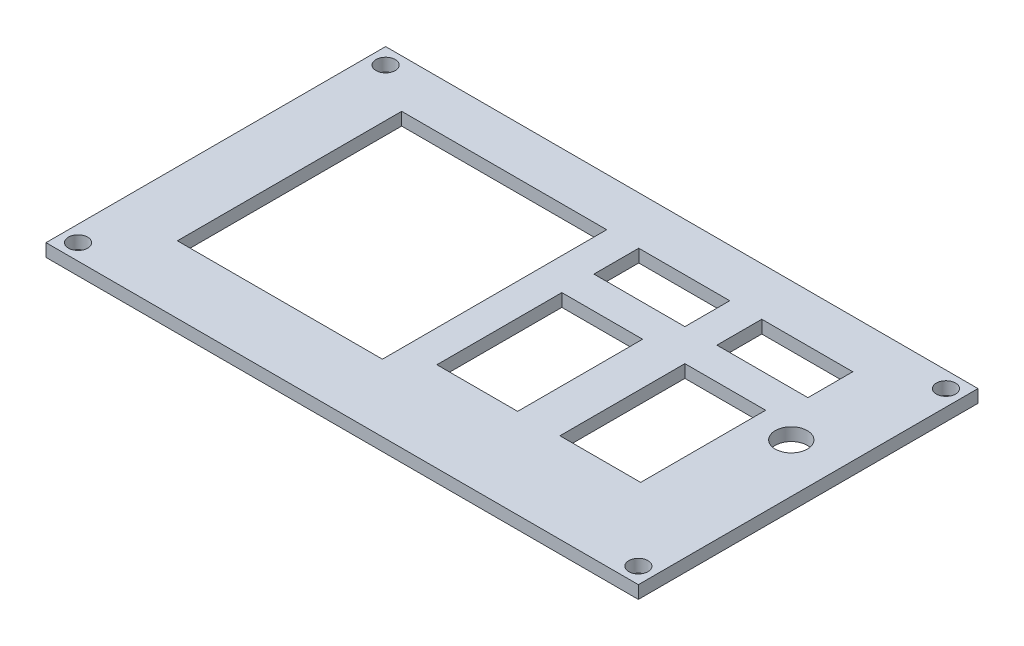
ISO-10303-21;
HEADER;
FILE_DESCRIPTION(('STEP AP214'),'2;1');
FILE_NAME('part.step','',(''),(''),'','','');
FILE_SCHEMA(('AUTOMOTIVE_DESIGN { 1 0 10303 214 1 1 1 1 }'));
ENDSEC;
DATA;
#1=APPLICATION_CONTEXT('core data for automotive mechanical design processes');
#2=APPLICATION_PROTOCOL_DEFINITION('international standard','automotive_design',2000,#1);
#3=PRODUCT_CONTEXT('',#1,'mechanical');
#4=PRODUCT('Part','Part','',(#3));
#5=PRODUCT_RELATED_PRODUCT_CATEGORY('part','',(#4));
#6=PRODUCT_DEFINITION_FORMATION('','',#4);
#7=PRODUCT_DEFINITION_CONTEXT('part definition',#1,'design');
#8=PRODUCT_DEFINITION('design','',#6,#7);
#9=PRODUCT_DEFINITION_SHAPE('','',#8);
#10=(LENGTH_UNIT() NAMED_UNIT(*) SI_UNIT(.MILLI.,.METRE.));
#11=(NAMED_UNIT(*) PLANE_ANGLE_UNIT() SI_UNIT($,.RADIAN.));
#12=(NAMED_UNIT(*) SI_UNIT($,.STERADIAN.) SOLID_ANGLE_UNIT());
#13=UNCERTAINTY_MEASURE_WITH_UNIT(LENGTH_MEASURE(1.E-05),#10,'distance_accuracy_value','');
#14=(GEOMETRIC_REPRESENTATION_CONTEXT(3) GLOBAL_UNCERTAINTY_ASSIGNED_CONTEXT((#13)) GLOBAL_UNIT_ASSIGNED_CONTEXT((#10,
#11,#12)) REPRESENTATION_CONTEXT('',''));
#15=CARTESIAN_POINT('',(0.,0.,0.));
#16=DIRECTION('',(0.,0.,1.));
#17=DIRECTION('',(1.,0.,0.));
#18=AXIS2_PLACEMENT_3D('',#15,#16,#17);
#19=CARTESIAN_POINT('',(46.22,2.,-26.5));
#20=DIRECTION('',(-1.,0.,0.));
#21=DIRECTION('',(0.,0.,1.));
#22=AXIS2_PLACEMENT_3D('',#19,#20,#21);
#23=PLANE('',#22);
#24=DIRECTION('',(0.,0.,-1.));
#25=VECTOR('',#24,1.);
#26=CARTESIAN_POINT('',(46.22,0.,-26.5));
#27=LINE('',#26,#25);
#28=CARTESIAN_POINT('',(46.22,0.,26.5));
#29=VERTEX_POINT('',#28);
#30=CARTESIAN_POINT('',(46.22,0.,-26.5));
#31=VERTEX_POINT('',#30);
#32=EDGE_CURVE('E461',#29,#31,#27,.T.);
#33=ORIENTED_EDGE('',*,*,#32,.T.);
#34=DIRECTION('',(0.,-1.,0.));
#35=VECTOR('',#34,1.);
#36=CARTESIAN_POINT('',(46.22,2.,-26.5));
#37=LINE('',#36,#35);
#38=CARTESIAN_POINT('',(46.22,2.,-26.5));
#39=VERTEX_POINT('',#38);
#40=EDGE_CURVE('E11',#39,#31,#37,.T.);
#41=ORIENTED_EDGE('',*,*,#40,.F.);
#42=DIRECTION('',(0.,0.,-1.));
#43=VECTOR('',#42,1.);
#44=CARTESIAN_POINT('',(46.22,2.,-26.5));
#45=LINE('',#44,#43);
#46=CARTESIAN_POINT('',(46.22,2.,26.5));
#47=VERTEX_POINT('',#46);
#48=EDGE_CURVE('E465',#47,#39,#45,.T.);
#49=ORIENTED_EDGE('',*,*,#48,.F.);
#50=DIRECTION('',(0.,-1.,0.));
#51=VECTOR('',#50,1.);
#52=CARTESIAN_POINT('',(46.22,2.,26.5));
#53=LINE('',#52,#51);
#54=EDGE_CURVE('E479',#47,#29,#53,.T.);
#55=ORIENTED_EDGE('',*,*,#54,.T.);
#56=EDGE_LOOP('',(#33,#41,#49,#55));
#57=FACE_BOUND('',#56,.T.);
#58=ADVANCED_FACE('F38',(#57),#23,.F.);
#59=CARTESIAN_POINT('',(-46.22,2.,-26.5));
#60=DIRECTION('',(0.,0.,1.));
#61=DIRECTION('',(1.,0.,0.));
#62=AXIS2_PLACEMENT_3D('',#59,#60,#61);
#63=PLANE('',#62);
#64=DIRECTION('',(-1.,0.,0.));
#65=VECTOR('',#64,1.);
#66=CARTESIAN_POINT('',(-46.22,0.,-26.5));
#67=LINE('',#66,#65);
#68=CARTESIAN_POINT('',(-46.22,0.,-26.5));
#69=VERTEX_POINT('',#68);
#70=EDGE_CURVE('E483',#31,#69,#67,.T.);
#71=ORIENTED_EDGE('',*,*,#70,.T.);
#72=DIRECTION('',(0.,-1.,0.));
#73=VECTOR('',#72,1.);
#74=CARTESIAN_POINT('',(-46.22,2.,-26.5));
#75=LINE('',#74,#73);
#76=CARTESIAN_POINT('',(-46.22,2.,-26.5));
#77=VERTEX_POINT('',#76);
#78=EDGE_CURVE('E46',#77,#69,#75,.T.);
#79=ORIENTED_EDGE('',*,*,#78,.F.);
#80=DIRECTION('',(-1.,0.,0.));
#81=VECTOR('',#80,1.);
#82=CARTESIAN_POINT('',(-46.22,2.,-26.5));
#83=LINE('',#82,#81);
#84=EDGE_CURVE('E469',#39,#77,#83,.T.);
#85=ORIENTED_EDGE('',*,*,#84,.F.);
#86=ORIENTED_EDGE('',*,*,#40,.T.);
#87=EDGE_LOOP('',(#71,#79,#85,#86));
#88=FACE_BOUND('',#87,.T.);
#89=ADVANCED_FACE('F518',(#88),#63,.F.);
#90=CARTESIAN_POINT('',(-46.22,2.,-26.5));
#91=DIRECTION('',(1.,0.,0.));
#92=DIRECTION('',(0.,0.,-1.));
#93=AXIS2_PLACEMENT_3D('',#90,#91,#92);
#94=PLANE('',#93);
#95=DIRECTION('',(0.,0.,1.));
#96=VECTOR('',#95,1.);
#97=CARTESIAN_POINT('',(-46.22,0.,-26.5));
#98=LINE('',#97,#96);
#99=CARTESIAN_POINT('',(-46.22,0.,26.5));
#100=VERTEX_POINT('',#99);
#101=EDGE_CURVE('E486',#69,#100,#98,.T.);
#102=ORIENTED_EDGE('',*,*,#101,.T.);
#103=DIRECTION('',(0.,-1.,0.));
#104=VECTOR('',#103,1.);
#105=CARTESIAN_POINT('',(-46.22,2.,26.5));
#106=LINE('',#105,#104);
#107=CARTESIAN_POINT('',(-46.22,2.,26.5));
#108=VERTEX_POINT('',#107);
#109=EDGE_CURVE('E494',#108,#100,#106,.T.);
#110=ORIENTED_EDGE('',*,*,#109,.F.);
#111=DIRECTION('',(0.,0.,1.));
#112=VECTOR('',#111,1.);
#113=CARTESIAN_POINT('',(-46.22,2.,-26.5));
#114=LINE('',#113,#112);
#115=EDGE_CURVE('E473',#77,#108,#114,.T.);
#116=ORIENTED_EDGE('',*,*,#115,.F.);
#117=ORIENTED_EDGE('',*,*,#78,.T.);
#118=EDGE_LOOP('',(#102,#110,#116,#117));
#119=FACE_BOUND('',#118,.T.);
#120=ADVANCED_FACE('F503',(#119),#94,.F.);
#121=CARTESIAN_POINT('',(-46.22,2.,26.5));
#122=DIRECTION('',(0.,0.,-1.));
#123=DIRECTION('',(-1.,0.,0.));
#124=AXIS2_PLACEMENT_3D('',#121,#122,#123);
#125=PLANE('',#124);
#126=DIRECTION('',(1.,0.,0.));
#127=VECTOR('',#126,1.);
#128=CARTESIAN_POINT('',(-46.22,0.,26.5));
#129=LINE('',#128,#127);
#130=EDGE_CURVE('E470',#100,#29,#129,.T.);
#131=ORIENTED_EDGE('',*,*,#130,.T.);
#132=ORIENTED_EDGE('',*,*,#54,.F.);
#133=DIRECTION('',(1.,0.,0.));
#134=VECTOR('',#133,1.);
#135=CARTESIAN_POINT('',(-46.22,2.,26.5));
#136=LINE('',#135,#134);
#137=EDGE_CURVE('E476',#108,#47,#136,.T.);
#138=ORIENTED_EDGE('',*,*,#137,.F.);
#139=ORIENTED_EDGE('',*,*,#109,.T.);
#140=EDGE_LOOP('',(#131,#132,#138,#139));
#141=FACE_BOUND('',#140,.T.);
#142=ADVANCED_FACE('F511',(#141),#125,.F.);
#143=CARTESIAN_POINT('',(0.,2.,0.));
#144=DIRECTION('',(0.,1.,0.));
#145=DIRECTION('',(0.,0.,1.));
#146=AXIS2_PLACEMENT_3D('',#143,#144,#145);
#147=PLANE('',#146);
#148=DIRECTION('',(0.,0.,1.));
#149=VECTOR('',#148,1.);
#150=CARTESIAN_POINT('',(-36.22,2.,-19.));
#151=LINE('',#150,#149);
#152=CARTESIAN_POINT('',(-36.22,2.,-19.));
#153=VERTEX_POINT('',#152);
#154=CARTESIAN_POINT('',(-36.22,2.,16.));
#155=VERTEX_POINT('',#154);
#156=EDGE_CURVE('E53',#153,#155,#151,.T.);
#157=ORIENTED_EDGE('',*,*,#156,.F.);
#158=DIRECTION('',(-1.,0.,0.));
#159=VECTOR('',#158,1.);
#160=CARTESIAN_POINT('',(-36.22,2.,-19.));
#161=LINE('',#160,#159);
#162=CARTESIAN_POINT('',(-4.21999999999998,2.,-19.));
#163=VERTEX_POINT('',#162);
#164=EDGE_CURVE('E223',#163,#153,#161,.T.);
#165=ORIENTED_EDGE('',*,*,#164,.F.);
#166=DIRECTION('',(0.,0.,-1.));
#167=VECTOR('',#166,1.);
#168=CARTESIAN_POINT('',(-4.21999999999998,2.,-19.));
#169=LINE('',#168,#167);
#170=CARTESIAN_POINT('',(-4.21999999999998,2.,16.));
#171=VERTEX_POINT('',#170);
#172=EDGE_CURVE('E227',#171,#163,#169,.T.);
#173=ORIENTED_EDGE('',*,*,#172,.F.);
#174=DIRECTION('',(1.,0.,0.));
#175=VECTOR('',#174,1.);
#176=CARTESIAN_POINT('',(-36.22,2.,16.));
#177=LINE('',#176,#175);
#178=EDGE_CURVE('E236',#155,#171,#177,.T.);
#179=ORIENTED_EDGE('',*,*,#178,.F.);
#180=EDGE_LOOP('',(#157,#165,#173,#179));
#181=FACE_BOUND('',#180,.T.);
#182=DIRECTION('',(0.,0.,1.));
#183=VECTOR('',#182,1.);
#184=CARTESIAN_POINT('',(0.780000000000015,2.,-19.));
#185=LINE('',#184,#183);
#186=CARTESIAN_POINT('',(0.780000000000015,2.,-19.));
#187=VERTEX_POINT('',#186);
#188=CARTESIAN_POINT('',(0.780000000000016,2.,-12.));
#189=VERTEX_POINT('',#188);
#190=EDGE_CURVE('E61',#187,#189,#185,.T.);
#191=ORIENTED_EDGE('',*,*,#190,.F.);
#192=DIRECTION('',(-1.,0.,0.));
#193=VECTOR('',#192,1.);
#194=CARTESIAN_POINT('',(0.780000000000015,2.,-19.));
#195=LINE('',#194,#193);
#196=CARTESIAN_POINT('',(14.98,2.,-19.));
#197=VERTEX_POINT('',#196);
#198=EDGE_CURVE('E257',#197,#187,#195,.T.);
#199=ORIENTED_EDGE('',*,*,#198,.F.);
#200=DIRECTION('',(0.,0.,-1.));
#201=VECTOR('',#200,1.);
#202=CARTESIAN_POINT('',(14.98,2.,-19.));
#203=LINE('',#202,#201);
#204=CARTESIAN_POINT('',(14.98,2.,-12.));
#205=VERTEX_POINT('',#204);
#206=EDGE_CURVE('E277',#205,#197,#203,.T.);
#207=ORIENTED_EDGE('',*,*,#206,.F.);
#208=DIRECTION('',(1.,0.,0.));
#209=VECTOR('',#208,1.);
#210=CARTESIAN_POINT('',(0.780000000000016,2.,-12.));
#211=LINE('',#210,#209);
#212=EDGE_CURVE('E272',#189,#205,#211,.T.);
#213=ORIENTED_EDGE('',*,*,#212,.F.);
#214=EDGE_LOOP('',(#191,#199,#207,#213));
#215=FACE_BOUND('',#214,.T.);
#216=DIRECTION('',(0.,0.,1.));
#217=VECTOR('',#216,1.);
#218=CARTESIAN_POINT('',(19.98,2.,-19.));
#219=LINE('',#218,#217);
#220=CARTESIAN_POINT('',(19.98,2.,-19.));
#221=VERTEX_POINT('',#220);
#222=CARTESIAN_POINT('',(19.98,2.,-12.));
#223=VERTEX_POINT('',#222);
#224=EDGE_CURVE('E312',#221,#223,#219,.T.);
#225=ORIENTED_EDGE('',*,*,#224,.F.);
#226=DIRECTION('',(-1.,0.,0.));
#227=VECTOR('',#226,1.);
#228=CARTESIAN_POINT('',(19.98,2.,-19.));
#229=LINE('',#228,#227);
#230=CARTESIAN_POINT('',(34.18,2.,-19.));
#231=VERTEX_POINT('',#230);
#232=EDGE_CURVE('E299',#231,#221,#229,.T.);
#233=ORIENTED_EDGE('',*,*,#232,.F.);
#234=DIRECTION('',(0.,0.,-1.));
#235=VECTOR('',#234,1.);
#236=CARTESIAN_POINT('',(34.18,2.,-19.));
#237=LINE('',#236,#235);
#238=CARTESIAN_POINT('',(34.18,2.,-12.));
#239=VERTEX_POINT('',#238);
#240=EDGE_CURVE('E320',#239,#231,#237,.T.);
#241=ORIENTED_EDGE('',*,*,#240,.F.);
#242=DIRECTION('',(1.,0.,0.));
#243=VECTOR('',#242,1.);
#244=CARTESIAN_POINT('',(19.98,2.,-12.));
#245=LINE('',#244,#243);
#246=EDGE_CURVE('E315',#223,#239,#245,.T.);
#247=ORIENTED_EDGE('',*,*,#246,.F.);
#248=EDGE_LOOP('',(#225,#233,#241,#247));
#249=FACE_BOUND('',#248,.T.);
#250=DIRECTION('',(0.,0.,1.));
#251=VECTOR('',#250,1.);
#252=CARTESIAN_POINT('',(0.780000000000017,2.,-7.));
#253=LINE('',#252,#251);
#254=CARTESIAN_POINT('',(0.780000000000017,2.,-7.));
#255=VERTEX_POINT('',#254);
#256=CARTESIAN_POINT('',(0.780000000000019,2.,12.5));
#257=VERTEX_POINT('',#256);
#258=EDGE_CURVE('E356',#255,#257,#253,.T.);
#259=ORIENTED_EDGE('',*,*,#258,.F.);
#260=DIRECTION('',(-1.,0.,0.));
#261=VECTOR('',#260,1.);
#262=CARTESIAN_POINT('',(0.780000000000017,2.,-7.));
#263=LINE('',#262,#261);
#264=CARTESIAN_POINT('',(13.38,2.,-7.));
#265=VERTEX_POINT('',#264);
#266=EDGE_CURVE('E343',#265,#255,#263,.T.);
#267=ORIENTED_EDGE('',*,*,#266,.F.);
#268=DIRECTION('',(0.,0.,-1.));
#269=VECTOR('',#268,1.);
#270=CARTESIAN_POINT('',(13.38,2.,-7.));
#271=LINE('',#270,#269);
#272=CARTESIAN_POINT('',(13.38,2.,12.5));
#273=VERTEX_POINT('',#272);
#274=EDGE_CURVE('E364',#273,#265,#271,.T.);
#275=ORIENTED_EDGE('',*,*,#274,.F.);
#276=DIRECTION('',(1.,0.,0.));
#277=VECTOR('',#276,1.);
#278=CARTESIAN_POINT('',(0.780000000000019,2.,12.5));
#279=LINE('',#278,#277);
#280=EDGE_CURVE('E359',#257,#273,#279,.T.);
#281=ORIENTED_EDGE('',*,*,#280,.F.);
#282=EDGE_LOOP('',(#259,#267,#275,#281));
#283=FACE_BOUND('',#282,.T.);
#284=DIRECTION('',(0.,0.,1.));
#285=VECTOR('',#284,1.);
#286=CARTESIAN_POINT('',(19.98,2.,-7.));
#287=LINE('',#286,#285);
#288=CARTESIAN_POINT('',(19.98,2.,-7.));
#289=VERTEX_POINT('',#288);
#290=CARTESIAN_POINT('',(19.98,2.,12.5));
#291=VERTEX_POINT('',#290);
#292=EDGE_CURVE('E400',#289,#291,#287,.T.);
#293=ORIENTED_EDGE('',*,*,#292,.F.);
#294=DIRECTION('',(-1.,0.,0.));
#295=VECTOR('',#294,1.);
#296=CARTESIAN_POINT('',(19.98,2.,-7.));
#297=LINE('',#296,#295);
#298=CARTESIAN_POINT('',(32.58,2.,-7.));
#299=VERTEX_POINT('',#298);
#300=EDGE_CURVE('E387',#299,#289,#297,.T.);
#301=ORIENTED_EDGE('',*,*,#300,.F.);
#302=DIRECTION('',(0.,0.,-1.));
#303=VECTOR('',#302,1.);
#304=CARTESIAN_POINT('',(32.58,2.,-7.));
#305=LINE('',#304,#303);
#306=CARTESIAN_POINT('',(32.58,2.,12.5));
#307=VERTEX_POINT('',#306);
#308=EDGE_CURVE('E408',#307,#299,#305,.T.);
#309=ORIENTED_EDGE('',*,*,#308,.F.);
#310=DIRECTION('',(1.,0.,0.));
#311=VECTOR('',#310,1.);
#312=CARTESIAN_POINT('',(19.98,2.,12.5));
#313=LINE('',#312,#311);
#314=EDGE_CURVE('E403',#291,#307,#313,.T.);
#315=ORIENTED_EDGE('',*,*,#314,.F.);
#316=EDGE_LOOP('',(#293,#301,#309,#315));
#317=FACE_BOUND('',#316,.T.);
#318=CARTESIAN_POINT('',(38.58,2.,-5.));
#319=DIRECTION('',(0.,1.,0.));
#320=DIRECTION('',(0.,0.,1.));
#321=AXIS2_PLACEMENT_3D('',#318,#319,#320);
#322=CIRCLE('',#321,2.5);
#323=CARTESIAN_POINT('',(38.58,2.,-2.5));
#324=VERTEX_POINT('',#323);
#325=EDGE_CURVE('E429',#324,#324,#322,.T.);
#326=ORIENTED_EDGE('',*,*,#325,.F.);
#327=EDGE_LOOP('',(#326));
#328=FACE_BOUND('',#327,.T.);
#329=CARTESIAN_POINT('',(-43.72,2.,24.));
#330=DIRECTION('',(0.,1.,0.));
#331=DIRECTION('',(0.,0.,1.));
#332=AXIS2_PLACEMENT_3D('',#329,#330,#331);
#333=CIRCLE('',#332,1.5);
#334=CARTESIAN_POINT('',(-43.72,2.,25.5));
#335=VERTEX_POINT('',#334);
#336=EDGE_CURVE('E246',#335,#335,#333,.T.);
#337=ORIENTED_EDGE('',*,*,#336,.F.);
#338=EDGE_LOOP('',(#337));
#339=FACE_BOUND('',#338,.T.);
#340=CARTESIAN_POINT('',(43.72,2.,24.));
#341=DIRECTION('',(0.,1.,0.));
#342=DIRECTION('',(0.,0.,1.));
#343=AXIS2_PLACEMENT_3D('',#340,#341,#342);
#344=CIRCLE('',#343,1.5);
#345=CARTESIAN_POINT('',(43.72,2.,25.5));
#346=VERTEX_POINT('',#345);
#347=EDGE_CURVE('E446',#346,#346,#344,.T.);
#348=ORIENTED_EDGE('',*,*,#347,.F.);
#349=EDGE_LOOP('',(#348));
#350=FACE_BOUND('',#349,.T.);
#351=CARTESIAN_POINT('',(43.72,2.,-24.));
#352=DIRECTION('',(0.,1.,0.));
#353=DIRECTION('',(0.,0.,1.));
#354=AXIS2_PLACEMENT_3D('',#351,#352,#353);
#355=CIRCLE('',#354,1.5);
#356=CARTESIAN_POINT('',(43.72,2.,-22.5));
#357=VERTEX_POINT('',#356);
#358=EDGE_CURVE('E438',#357,#357,#355,.T.);
#359=ORIENTED_EDGE('',*,*,#358,.F.);
#360=EDGE_LOOP('',(#359));
#361=FACE_BOUND('',#360,.T.);
#362=CARTESIAN_POINT('',(-43.72,2.,-24.));
#363=DIRECTION('',(0.,1.,0.));
#364=DIRECTION('',(0.,0.,1.));
#365=AXIS2_PLACEMENT_3D('',#362,#363,#364);
#366=CIRCLE('',#365,1.5);
#367=CARTESIAN_POINT('',(-43.72,2.,-22.5));
#368=VERTEX_POINT('',#367);
#369=EDGE_CURVE('E437',#368,#368,#366,.T.);
#370=ORIENTED_EDGE('',*,*,#369,.F.);
#371=EDGE_LOOP('',(#370));
#372=FACE_BOUND('',#371,.T.);
#373=ORIENTED_EDGE('',*,*,#48,.T.);
#374=ORIENTED_EDGE('',*,*,#84,.T.);
#375=ORIENTED_EDGE('',*,*,#115,.T.);
#376=ORIENTED_EDGE('',*,*,#137,.T.);
#377=EDGE_LOOP('',(#373,#374,#375,#376));
#378=FACE_BOUND('',#377,.T.);
#379=ADVANCED_FACE('F517',(#181,#215,#249,#283,#317,#328,#339,#350,#361,#372,#378),#147,.T.);
#380=CARTESIAN_POINT('',(0.,0.,0.));
#381=DIRECTION('',(0.,1.,0.));
#382=DIRECTION('',(0.,0.,1.));
#383=AXIS2_PLACEMENT_3D('',#380,#381,#382);
#384=PLANE('',#383);
#385=DIRECTION('',(-1.,0.,0.));
#386=VECTOR('',#385,1.);
#387=CARTESIAN_POINT('',(-36.22,0.,-19.));
#388=LINE('',#387,#386);
#389=CARTESIAN_POINT('',(-4.21999999999998,0.,-19.));
#390=VERTEX_POINT('',#389);
#391=CARTESIAN_POINT('',(-36.22,0.,-19.));
#392=VERTEX_POINT('',#391);
#393=EDGE_CURVE('E208',#390,#392,#388,.T.);
#394=ORIENTED_EDGE('',*,*,#393,.T.);
#395=DIRECTION('',(0.,0.,1.));
#396=VECTOR('',#395,1.);
#397=CARTESIAN_POINT('',(-36.22,0.,-19.));
#398=LINE('',#397,#396);
#399=CARTESIAN_POINT('',(-36.22,0.,16.));
#400=VERTEX_POINT('',#399);
#401=EDGE_CURVE('E201',#392,#400,#398,.T.);
#402=ORIENTED_EDGE('',*,*,#401,.T.);
#403=DIRECTION('',(1.,0.,0.));
#404=VECTOR('',#403,1.);
#405=CARTESIAN_POINT('',(-36.22,0.,16.));
#406=LINE('',#405,#404);
#407=CARTESIAN_POINT('',(-4.21999999999998,0.,16.));
#408=VERTEX_POINT('',#407);
#409=EDGE_CURVE('E212',#400,#408,#406,.T.);
#410=ORIENTED_EDGE('',*,*,#409,.T.);
#411=DIRECTION('',(0.,0.,-1.));
#412=VECTOR('',#411,1.);
#413=CARTESIAN_POINT('',(-4.21999999999998,0.,-19.));
#414=LINE('',#413,#412);
#415=EDGE_CURVE('E217',#408,#390,#414,.T.);
#416=ORIENTED_EDGE('',*,*,#415,.T.);
#417=EDGE_LOOP('',(#394,#402,#410,#416));
#418=FACE_BOUND('',#417,.T.);
#419=DIRECTION('',(-1.,0.,0.));
#420=VECTOR('',#419,1.);
#421=CARTESIAN_POINT('',(0.780000000000015,0.,-19.));
#422=LINE('',#421,#420);
#423=CARTESIAN_POINT('',(14.98,0.,-19.));
#424=VERTEX_POINT('',#423);
#425=CARTESIAN_POINT('',(0.780000000000015,0.,-19.));
#426=VERTEX_POINT('',#425);
#427=EDGE_CURVE('E265',#424,#426,#422,.T.);
#428=ORIENTED_EDGE('',*,*,#427,.T.);
#429=DIRECTION('',(0.,0.,1.));
#430=VECTOR('',#429,1.);
#431=CARTESIAN_POINT('',(0.780000000000015,0.,-19.));
#432=LINE('',#431,#430);
#433=CARTESIAN_POINT('',(0.780000000000016,0.,-12.));
#434=VERTEX_POINT('',#433);
#435=EDGE_CURVE('E252',#426,#434,#432,.T.);
#436=ORIENTED_EDGE('',*,*,#435,.T.);
#437=DIRECTION('',(1.,0.,0.));
#438=VECTOR('',#437,1.);
#439=CARTESIAN_POINT('',(0.780000000000016,0.,-12.));
#440=LINE('',#439,#438);
#441=CARTESIAN_POINT('',(14.98,0.,-12.));
#442=VERTEX_POINT('',#441);
#443=EDGE_CURVE('E256',#434,#442,#440,.T.);
#444=ORIENTED_EDGE('',*,*,#443,.T.);
#445=DIRECTION('',(0.,0.,-1.));
#446=VECTOR('',#445,1.);
#447=CARTESIAN_POINT('',(14.98,0.,-19.));
#448=LINE('',#447,#446);
#449=EDGE_CURVE('E261',#442,#424,#448,.T.);
#450=ORIENTED_EDGE('',*,*,#449,.T.);
#451=EDGE_LOOP('',(#428,#436,#444,#450));
#452=FACE_BOUND('',#451,.T.);
#453=DIRECTION('',(-1.,0.,0.));
#454=VECTOR('',#453,1.);
#455=CARTESIAN_POINT('',(19.98,0.,-19.));
#456=LINE('',#455,#454);
#457=CARTESIAN_POINT('',(34.18,0.,-19.));
#458=VERTEX_POINT('',#457);
#459=CARTESIAN_POINT('',(19.98,0.,-19.));
#460=VERTEX_POINT('',#459);
#461=EDGE_CURVE('E307',#458,#460,#456,.T.);
#462=ORIENTED_EDGE('',*,*,#461,.T.);
#463=DIRECTION('',(0.,0.,1.));
#464=VECTOR('',#463,1.);
#465=CARTESIAN_POINT('',(19.98,0.,-19.));
#466=LINE('',#465,#464);
#467=CARTESIAN_POINT('',(19.98,0.,-12.));
#468=VERTEX_POINT('',#467);
#469=EDGE_CURVE('E294',#460,#468,#466,.T.);
#470=ORIENTED_EDGE('',*,*,#469,.T.);
#471=DIRECTION('',(1.,0.,0.));
#472=VECTOR('',#471,1.);
#473=CARTESIAN_POINT('',(19.98,0.,-12.));
#474=LINE('',#473,#472);
#475=CARTESIAN_POINT('',(34.18,0.,-12.));
#476=VERTEX_POINT('',#475);
#477=EDGE_CURVE('E298',#468,#476,#474,.T.);
#478=ORIENTED_EDGE('',*,*,#477,.T.);
#479=DIRECTION('',(0.,0.,-1.));
#480=VECTOR('',#479,1.);
#481=CARTESIAN_POINT('',(34.18,0.,-19.));
#482=LINE('',#481,#480);
#483=EDGE_CURVE('E303',#476,#458,#482,.T.);
#484=ORIENTED_EDGE('',*,*,#483,.T.);
#485=EDGE_LOOP('',(#462,#470,#478,#484));
#486=FACE_BOUND('',#485,.T.);
#487=DIRECTION('',(-1.,0.,0.));
#488=VECTOR('',#487,1.);
#489=CARTESIAN_POINT('',(0.780000000000017,0.,-7.));
#490=LINE('',#489,#488);
#491=CARTESIAN_POINT('',(13.38,0.,-7.));
#492=VERTEX_POINT('',#491);
#493=CARTESIAN_POINT('',(0.780000000000017,0.,-7.));
#494=VERTEX_POINT('',#493);
#495=EDGE_CURVE('E351',#492,#494,#490,.T.);
#496=ORIENTED_EDGE('',*,*,#495,.T.);
#497=DIRECTION('',(0.,0.,1.));
#498=VECTOR('',#497,1.);
#499=CARTESIAN_POINT('',(0.780000000000017,0.,-7.));
#500=LINE('',#499,#498);
#501=CARTESIAN_POINT('',(0.780000000000019,0.,12.5));
#502=VERTEX_POINT('',#501);
#503=EDGE_CURVE('E338',#494,#502,#500,.T.);
#504=ORIENTED_EDGE('',*,*,#503,.T.);
#505=DIRECTION('',(1.,0.,0.));
#506=VECTOR('',#505,1.);
#507=CARTESIAN_POINT('',(0.780000000000019,0.,12.5));
#508=LINE('',#507,#506);
#509=CARTESIAN_POINT('',(13.38,0.,12.5));
#510=VERTEX_POINT('',#509);
#511=EDGE_CURVE('E342',#502,#510,#508,.T.);
#512=ORIENTED_EDGE('',*,*,#511,.T.);
#513=DIRECTION('',(0.,0.,-1.));
#514=VECTOR('',#513,1.);
#515=CARTESIAN_POINT('',(13.38,0.,-7.));
#516=LINE('',#515,#514);
#517=EDGE_CURVE('E347',#510,#492,#516,.T.);
#518=ORIENTED_EDGE('',*,*,#517,.T.);
#519=EDGE_LOOP('',(#496,#504,#512,#518));
#520=FACE_BOUND('',#519,.T.);
#521=DIRECTION('',(-1.,0.,0.));
#522=VECTOR('',#521,1.);
#523=CARTESIAN_POINT('',(19.98,0.,-7.));
#524=LINE('',#523,#522);
#525=CARTESIAN_POINT('',(32.58,0.,-7.));
#526=VERTEX_POINT('',#525);
#527=CARTESIAN_POINT('',(19.98,0.,-7.));
#528=VERTEX_POINT('',#527);
#529=EDGE_CURVE('E395',#526,#528,#524,.T.);
#530=ORIENTED_EDGE('',*,*,#529,.T.);
#531=DIRECTION('',(0.,0.,1.));
#532=VECTOR('',#531,1.);
#533=CARTESIAN_POINT('',(19.98,0.,-7.));
#534=LINE('',#533,#532);
#535=CARTESIAN_POINT('',(19.98,0.,12.5));
#536=VERTEX_POINT('',#535);
#537=EDGE_CURVE('E382',#528,#536,#534,.T.);
#538=ORIENTED_EDGE('',*,*,#537,.T.);
#539=DIRECTION('',(1.,0.,0.));
#540=VECTOR('',#539,1.);
#541=CARTESIAN_POINT('',(19.98,0.,12.5));
#542=LINE('',#541,#540);
#543=CARTESIAN_POINT('',(32.58,0.,12.5));
#544=VERTEX_POINT('',#543);
#545=EDGE_CURVE('E386',#536,#544,#542,.T.);
#546=ORIENTED_EDGE('',*,*,#545,.T.);
#547=DIRECTION('',(0.,0.,-1.));
#548=VECTOR('',#547,1.);
#549=CARTESIAN_POINT('',(32.58,0.,-7.));
#550=LINE('',#549,#548);
#551=EDGE_CURVE('E391',#544,#526,#550,.T.);
#552=ORIENTED_EDGE('',*,*,#551,.T.);
#553=EDGE_LOOP('',(#530,#538,#546,#552));
#554=FACE_BOUND('',#553,.T.);
#555=CARTESIAN_POINT('',(38.58,0.,-5.));
#556=DIRECTION('',(0.,1.,0.));
#557=DIRECTION('',(0.,0.,1.));
#558=AXIS2_PLACEMENT_3D('',#555,#556,#557);
#559=CIRCLE('',#558,2.5);
#560=CARTESIAN_POINT('',(38.58,0.,-2.5));
#561=VERTEX_POINT('',#560);
#562=EDGE_CURVE('E404',#561,#561,#559,.T.);
#563=ORIENTED_EDGE('',*,*,#562,.T.);
#564=EDGE_LOOP('',(#563));
#565=FACE_BOUND('',#564,.T.);
#566=CARTESIAN_POINT('',(-43.72,0.,24.));
#567=DIRECTION('',(0.,1.,0.));
#568=DIRECTION('',(0.,0.,1.));
#569=AXIS2_PLACEMENT_3D('',#566,#567,#568);
#570=CIRCLE('',#569,1.5);
#571=CARTESIAN_POINT('',(-43.72,0.,25.5));
#572=VERTEX_POINT('',#571);
#573=EDGE_CURVE('E450',#572,#572,#570,.T.);
#574=ORIENTED_EDGE('',*,*,#573,.T.);
#575=EDGE_LOOP('',(#574));
#576=FACE_BOUND('',#575,.T.);
#577=CARTESIAN_POINT('',(43.72,0.,24.));
#578=DIRECTION('',(0.,1.,0.));
#579=DIRECTION('',(0.,0.,1.));
#580=AXIS2_PLACEMENT_3D('',#577,#578,#579);
#581=CIRCLE('',#580,1.5);
#582=CARTESIAN_POINT('',(43.72,0.,25.5));
#583=VERTEX_POINT('',#582);
#584=EDGE_CURVE('E442',#583,#583,#581,.T.);
#585=ORIENTED_EDGE('',*,*,#584,.T.);
#586=EDGE_LOOP('',(#585));
#587=FACE_BOUND('',#586,.T.);
#588=CARTESIAN_POINT('',(43.72,0.,-24.));
#589=DIRECTION('',(0.,1.,0.));
#590=DIRECTION('',(0.,0.,1.));
#591=AXIS2_PLACEMENT_3D('',#588,#589,#590);
#592=CIRCLE('',#591,1.5);
#593=CARTESIAN_POINT('',(43.72,0.,-22.5));
#594=VERTEX_POINT('',#593);
#595=EDGE_CURVE('E433',#594,#594,#592,.T.);
#596=ORIENTED_EDGE('',*,*,#595,.T.);
#597=EDGE_LOOP('',(#596));
#598=FACE_BOUND('',#597,.T.);
#599=CARTESIAN_POINT('',(-43.72,0.,-24.));
#600=DIRECTION('',(0.,1.,0.));
#601=DIRECTION('',(0.,0.,1.));
#602=AXIS2_PLACEMENT_3D('',#599,#600,#601);
#603=CIRCLE('',#602,1.5);
#604=CARTESIAN_POINT('',(-43.72,0.,-22.5));
#605=VERTEX_POINT('',#604);
#606=EDGE_CURVE('E457',#605,#605,#603,.T.);
#607=ORIENTED_EDGE('',*,*,#606,.T.);
#608=EDGE_LOOP('',(#607));
#609=FACE_BOUND('',#608,.T.);
#610=ORIENTED_EDGE('',*,*,#32,.F.);
#611=ORIENTED_EDGE('',*,*,#130,.F.);
#612=ORIENTED_EDGE('',*,*,#101,.F.);
#613=ORIENTED_EDGE('',*,*,#70,.F.);
#614=EDGE_LOOP('',(#610,#611,#612,#613));
#615=FACE_BOUND('',#614,.T.);
#616=ADVANCED_FACE('F219',(#418,#452,#486,#520,#554,#565,#576,#587,#598,#609,#615),#384,.F.);
#617=CARTESIAN_POINT('',(-43.72,0.,-24.));
#618=DIRECTION('',(0.,1.,0.));
#619=DIRECTION('',(0.,0.,1.));
#620=AXIS2_PLACEMENT_3D('',#617,#618,#619);
#621=CYLINDRICAL_SURFACE('',#620,1.5);
#622=ORIENTED_EDGE('',*,*,#606,.F.);
#623=EDGE_LOOP('',(#622));
#624=FACE_BOUND('',#623,.T.);
#625=ORIENTED_EDGE('',*,*,#369,.T.);
#626=EDGE_LOOP('',(#625));
#627=FACE_BOUND('',#626,.T.);
#628=ADVANCED_FACE('F530',(#624,#627),#621,.F.);
#629=CARTESIAN_POINT('',(43.72,0.,-24.));
#630=DIRECTION('',(0.,1.,0.));
#631=DIRECTION('',(0.,0.,1.));
#632=AXIS2_PLACEMENT_3D('',#629,#630,#631);
#633=CYLINDRICAL_SURFACE('',#632,1.5);
#634=ORIENTED_EDGE('',*,*,#595,.F.);
#635=EDGE_LOOP('',(#634));
#636=FACE_BOUND('',#635,.T.);
#637=ORIENTED_EDGE('',*,*,#358,.T.);
#638=EDGE_LOOP('',(#637));
#639=FACE_BOUND('',#638,.T.);
#640=ADVANCED_FACE('F536',(#636,#639),#633,.F.);
#641=CARTESIAN_POINT('',(43.72,0.,24.));
#642=DIRECTION('',(0.,1.,0.));
#643=DIRECTION('',(0.,0.,1.));
#644=AXIS2_PLACEMENT_3D('',#641,#642,#643);
#645=CYLINDRICAL_SURFACE('',#644,1.5);
#646=ORIENTED_EDGE('',*,*,#584,.F.);
#647=EDGE_LOOP('',(#646));
#648=FACE_BOUND('',#647,.T.);
#649=ORIENTED_EDGE('',*,*,#347,.T.);
#650=EDGE_LOOP('',(#649));
#651=FACE_BOUND('',#650,.T.);
#652=ADVANCED_FACE('F542',(#648,#651),#645,.F.);
#653=CARTESIAN_POINT('',(-43.72,0.,24.));
#654=DIRECTION('',(0.,1.,0.));
#655=DIRECTION('',(0.,0.,1.));
#656=AXIS2_PLACEMENT_3D('',#653,#654,#655);
#657=CYLINDRICAL_SURFACE('',#656,1.5);
#658=ORIENTED_EDGE('',*,*,#573,.F.);
#659=EDGE_LOOP('',(#658));
#660=FACE_BOUND('',#659,.T.);
#661=ORIENTED_EDGE('',*,*,#336,.T.);
#662=EDGE_LOOP('',(#661));
#663=FACE_BOUND('',#662,.T.);
#664=ADVANCED_FACE('F538',(#660,#663),#657,.F.);
#665=CARTESIAN_POINT('',(38.58,0.,-5.));
#666=DIRECTION('',(0.,1.,0.));
#667=DIRECTION('',(0.,0.,1.));
#668=AXIS2_PLACEMENT_3D('',#665,#666,#667);
#669=CYLINDRICAL_SURFACE('',#668,2.5);
#670=ORIENTED_EDGE('',*,*,#562,.F.);
#671=EDGE_LOOP('',(#670));
#672=FACE_BOUND('',#671,.T.);
#673=ORIENTED_EDGE('',*,*,#325,.T.);
#674=EDGE_LOOP('',(#673));
#675=FACE_BOUND('',#674,.T.);
#676=ADVANCED_FACE('F541',(#672,#675),#669,.F.);
#677=CARTESIAN_POINT('',(19.98,0.,-7.));
#678=DIRECTION('',(-1.,0.,0.));
#679=DIRECTION('',(0.,0.,1.));
#680=AXIS2_PLACEMENT_3D('',#677,#678,#679);
#681=PLANE('',#680);
#682=ORIENTED_EDGE('',*,*,#292,.T.);
#683=DIRECTION('',(0.,1.,0.));
#684=VECTOR('',#683,1.);
#685=CARTESIAN_POINT('',(19.98,0.,12.5));
#686=LINE('',#685,#684);
#687=EDGE_CURVE('E399',#536,#291,#686,.T.);
#688=ORIENTED_EDGE('',*,*,#687,.F.);
#689=ORIENTED_EDGE('',*,*,#537,.F.);
#690=DIRECTION('',(0.,1.,0.));
#691=VECTOR('',#690,1.);
#692=CARTESIAN_POINT('',(19.98,0.,-7.));
#693=LINE('',#692,#691);
#694=EDGE_CURVE('E360',#528,#289,#693,.T.);
#695=ORIENTED_EDGE('',*,*,#694,.T.);
#696=EDGE_LOOP('',(#682,#688,#689,#695));
#697=FACE_BOUND('',#696,.T.);
#698=ADVANCED_FACE('F552',(#697),#681,.F.);
#699=CARTESIAN_POINT('',(19.98,0.,-7.));
#700=DIRECTION('',(0.,0.,-1.));
#701=DIRECTION('',(-1.,0.,0.));
#702=AXIS2_PLACEMENT_3D('',#699,#700,#701);
#703=PLANE('',#702);
#704=ORIENTED_EDGE('',*,*,#300,.T.);
#705=ORIENTED_EDGE('',*,*,#694,.F.);
#706=ORIENTED_EDGE('',*,*,#529,.F.);
#707=DIRECTION('',(0.,1.,0.));
#708=VECTOR('',#707,1.);
#709=CARTESIAN_POINT('',(32.58,0.,-7.));
#710=LINE('',#709,#708);
#711=EDGE_CURVE('E417',#526,#299,#710,.T.);
#712=ORIENTED_EDGE('',*,*,#711,.T.);
#713=EDGE_LOOP('',(#704,#705,#706,#712));
#714=FACE_BOUND('',#713,.T.);
#715=ADVANCED_FACE('F556',(#714),#703,.F.);
#716=CARTESIAN_POINT('',(32.58,0.,-7.));
#717=DIRECTION('',(1.,0.,0.));
#718=DIRECTION('',(0.,0.,-1.));
#719=AXIS2_PLACEMENT_3D('',#716,#717,#718);
#720=PLANE('',#719);
#721=ORIENTED_EDGE('',*,*,#308,.T.);
#722=ORIENTED_EDGE('',*,*,#711,.F.);
#723=ORIENTED_EDGE('',*,*,#551,.F.);
#724=DIRECTION('',(0.,1.,0.));
#725=VECTOR('',#724,1.);
#726=CARTESIAN_POINT('',(32.58,0.,12.5));
#727=LINE('',#726,#725);
#728=EDGE_CURVE('E420',#544,#307,#727,.T.);
#729=ORIENTED_EDGE('',*,*,#728,.T.);
#730=EDGE_LOOP('',(#721,#722,#723,#729));
#731=FACE_BOUND('',#730,.T.);
#732=ADVANCED_FACE('F562',(#731),#720,.F.);
#733=CARTESIAN_POINT('',(19.98,0.,12.5));
#734=DIRECTION('',(0.,0.,1.));
#735=DIRECTION('',(1.,0.,0.));
#736=AXIS2_PLACEMENT_3D('',#733,#734,#735);
#737=PLANE('',#736);
#738=ORIENTED_EDGE('',*,*,#314,.T.);
#739=ORIENTED_EDGE('',*,*,#728,.F.);
#740=ORIENTED_EDGE('',*,*,#545,.F.);
#741=ORIENTED_EDGE('',*,*,#687,.T.);
#742=EDGE_LOOP('',(#738,#739,#740,#741));
#743=FACE_BOUND('',#742,.T.);
#744=ADVANCED_FACE('F558',(#743),#737,.F.);
#745=CARTESIAN_POINT('',(0.780000000000017,0.,-7.));
#746=DIRECTION('',(-1.,0.,0.));
#747=DIRECTION('',(0.,0.,1.));
#748=AXIS2_PLACEMENT_3D('',#745,#746,#747);
#749=PLANE('',#748);
#750=ORIENTED_EDGE('',*,*,#258,.T.);
#751=DIRECTION('',(0.,1.,0.));
#752=VECTOR('',#751,1.);
#753=CARTESIAN_POINT('',(0.780000000000019,0.,12.5));
#754=LINE('',#753,#752);
#755=EDGE_CURVE('E355',#502,#257,#754,.T.);
#756=ORIENTED_EDGE('',*,*,#755,.F.);
#757=ORIENTED_EDGE('',*,*,#503,.F.);
#758=DIRECTION('',(0.,1.,0.));
#759=VECTOR('',#758,1.);
#760=CARTESIAN_POINT('',(0.780000000000017,0.,-7.));
#761=LINE('',#760,#759);
#762=EDGE_CURVE('E316',#494,#255,#761,.T.);
#763=ORIENTED_EDGE('',*,*,#762,.T.);
#764=EDGE_LOOP('',(#750,#756,#757,#763));
#765=FACE_BOUND('',#764,.T.);
#766=ADVANCED_FACE('F561',(#765),#749,.F.);
#767=CARTESIAN_POINT('',(0.780000000000017,0.,-7.));
#768=DIRECTION('',(0.,0.,-1.));
#769=DIRECTION('',(-1.,0.,0.));
#770=AXIS2_PLACEMENT_3D('',#767,#768,#769);
#771=PLANE('',#770);
#772=ORIENTED_EDGE('',*,*,#266,.T.);
#773=ORIENTED_EDGE('',*,*,#762,.F.);
#774=ORIENTED_EDGE('',*,*,#495,.F.);
#775=DIRECTION('',(0.,1.,0.));
#776=VECTOR('',#775,1.);
#777=CARTESIAN_POINT('',(13.38,0.,-7.));
#778=LINE('',#777,#776);
#779=EDGE_CURVE('E373',#492,#265,#778,.T.);
#780=ORIENTED_EDGE('',*,*,#779,.T.);
#781=EDGE_LOOP('',(#772,#773,#774,#780));
#782=FACE_BOUND('',#781,.T.);
#783=ADVANCED_FACE('F572',(#782),#771,.F.);
#784=CARTESIAN_POINT('',(13.38,0.,-7.));
#785=DIRECTION('',(1.,0.,0.));
#786=DIRECTION('',(0.,0.,-1.));
#787=AXIS2_PLACEMENT_3D('',#784,#785,#786);
#788=PLANE('',#787);
#789=ORIENTED_EDGE('',*,*,#274,.T.);
#790=ORIENTED_EDGE('',*,*,#779,.F.);
#791=ORIENTED_EDGE('',*,*,#517,.F.);
#792=DIRECTION('',(0.,1.,0.));
#793=VECTOR('',#792,1.);
#794=CARTESIAN_POINT('',(13.38,0.,12.5));
#795=LINE('',#794,#793);
#796=EDGE_CURVE('E376',#510,#273,#795,.T.);
#797=ORIENTED_EDGE('',*,*,#796,.T.);
#798=EDGE_LOOP('',(#789,#790,#791,#797));
#799=FACE_BOUND('',#798,.T.);
#800=ADVANCED_FACE('F578',(#799),#788,.F.);
#801=CARTESIAN_POINT('',(0.780000000000019,0.,12.5));
#802=DIRECTION('',(0.,0.,1.));
#803=DIRECTION('',(1.,0.,0.));
#804=AXIS2_PLACEMENT_3D('',#801,#802,#803);
#805=PLANE('',#804);
#806=ORIENTED_EDGE('',*,*,#280,.T.);
#807=ORIENTED_EDGE('',*,*,#796,.F.);
#808=ORIENTED_EDGE('',*,*,#511,.F.);
#809=ORIENTED_EDGE('',*,*,#755,.T.);
#810=EDGE_LOOP('',(#806,#807,#808,#809));
#811=FACE_BOUND('',#810,.T.);
#812=ADVANCED_FACE('F574',(#811),#805,.F.);
#813=CARTESIAN_POINT('',(19.98,0.,-19.));
#814=DIRECTION('',(-1.,0.,0.));
#815=DIRECTION('',(0.,0.,1.));
#816=AXIS2_PLACEMENT_3D('',#813,#814,#815);
#817=PLANE('',#816);
#818=ORIENTED_EDGE('',*,*,#224,.T.);
#819=DIRECTION('',(0.,1.,0.));
#820=VECTOR('',#819,1.);
#821=CARTESIAN_POINT('',(19.98,0.,-12.));
#822=LINE('',#821,#820);
#823=EDGE_CURVE('E311',#468,#223,#822,.T.);
#824=ORIENTED_EDGE('',*,*,#823,.F.);
#825=ORIENTED_EDGE('',*,*,#469,.F.);
#826=DIRECTION('',(0.,1.,0.));
#827=VECTOR('',#826,1.);
#828=CARTESIAN_POINT('',(19.98,0.,-19.));
#829=LINE('',#828,#827);
#830=EDGE_CURVE('E273',#460,#221,#829,.T.);
#831=ORIENTED_EDGE('',*,*,#830,.T.);
#832=EDGE_LOOP('',(#818,#824,#825,#831));
#833=FACE_BOUND('',#832,.T.);
#834=ADVANCED_FACE('F577',(#833),#817,.F.);
#835=CARTESIAN_POINT('',(19.98,0.,-19.));
#836=DIRECTION('',(0.,0.,-1.));
#837=DIRECTION('',(-1.,0.,0.));
#838=AXIS2_PLACEMENT_3D('',#835,#836,#837);
#839=PLANE('',#838);
#840=ORIENTED_EDGE('',*,*,#232,.T.);
#841=ORIENTED_EDGE('',*,*,#830,.F.);
#842=ORIENTED_EDGE('',*,*,#461,.F.);
#843=DIRECTION('',(0.,1.,0.));
#844=VECTOR('',#843,1.);
#845=CARTESIAN_POINT('',(34.18,0.,-19.));
#846=LINE('',#845,#844);
#847=EDGE_CURVE('E329',#458,#231,#846,.T.);
#848=ORIENTED_EDGE('',*,*,#847,.T.);
#849=EDGE_LOOP('',(#840,#841,#842,#848));
#850=FACE_BOUND('',#849,.T.);
#851=ADVANCED_FACE('F588',(#850),#839,.F.);
#852=CARTESIAN_POINT('',(34.18,0.,-19.));
#853=DIRECTION('',(1.,0.,0.));
#854=DIRECTION('',(0.,0.,-1.));
#855=AXIS2_PLACEMENT_3D('',#852,#853,#854);
#856=PLANE('',#855);
#857=ORIENTED_EDGE('',*,*,#240,.T.);
#858=ORIENTED_EDGE('',*,*,#847,.F.);
#859=ORIENTED_EDGE('',*,*,#483,.F.);
#860=DIRECTION('',(0.,1.,0.));
#861=VECTOR('',#860,1.);
#862=CARTESIAN_POINT('',(34.18,0.,-12.));
#863=LINE('',#862,#861);
#864=EDGE_CURVE('E332',#476,#239,#863,.T.);
#865=ORIENTED_EDGE('',*,*,#864,.T.);
#866=EDGE_LOOP('',(#857,#858,#859,#865));
#867=FACE_BOUND('',#866,.T.);
#868=ADVANCED_FACE('F594',(#867),#856,.F.);
#869=CARTESIAN_POINT('',(19.98,0.,-12.));
#870=DIRECTION('',(0.,0.,1.));
#871=DIRECTION('',(1.,0.,0.));
#872=AXIS2_PLACEMENT_3D('',#869,#870,#871);
#873=PLANE('',#872);
#874=ORIENTED_EDGE('',*,*,#246,.T.);
#875=ORIENTED_EDGE('',*,*,#864,.F.);
#876=ORIENTED_EDGE('',*,*,#477,.F.);
#877=ORIENTED_EDGE('',*,*,#823,.T.);
#878=EDGE_LOOP('',(#874,#875,#876,#877));
#879=FACE_BOUND('',#878,.T.);
#880=ADVANCED_FACE('F590',(#879),#873,.F.);
#881=CARTESIAN_POINT('',(0.780000000000015,0.,-19.));
#882=DIRECTION('',(-1.,0.,0.));
#883=DIRECTION('',(0.,0.,1.));
#884=AXIS2_PLACEMENT_3D('',#881,#882,#883);
#885=PLANE('',#884);
#886=ORIENTED_EDGE('',*,*,#190,.T.);
#887=DIRECTION('',(0.,1.,0.));
#888=VECTOR('',#887,1.);
#889=CARTESIAN_POINT('',(0.780000000000016,0.,-12.));
#890=LINE('',#889,#888);
#891=EDGE_CURVE('E269',#434,#189,#890,.T.);
#892=ORIENTED_EDGE('',*,*,#891,.F.);
#893=ORIENTED_EDGE('',*,*,#435,.F.);
#894=DIRECTION('',(0.,1.,0.));
#895=VECTOR('',#894,1.);
#896=CARTESIAN_POINT('',(0.780000000000015,0.,-19.));
#897=LINE('',#896,#895);
#898=EDGE_CURVE('E237',#426,#187,#897,.T.);
#899=ORIENTED_EDGE('',*,*,#898,.T.);
#900=EDGE_LOOP('',(#886,#892,#893,#899));
#901=FACE_BOUND('',#900,.T.);
#902=ADVANCED_FACE('F593',(#901),#885,.F.);
#903=CARTESIAN_POINT('',(0.780000000000015,0.,-19.));
#904=DIRECTION('',(0.,0.,-1.));
#905=DIRECTION('',(-1.,0.,0.));
#906=AXIS2_PLACEMENT_3D('',#903,#904,#905);
#907=PLANE('',#906);
#908=ORIENTED_EDGE('',*,*,#198,.T.);
#909=ORIENTED_EDGE('',*,*,#898,.F.);
#910=ORIENTED_EDGE('',*,*,#427,.F.);
#911=DIRECTION('',(0.,1.,0.));
#912=VECTOR('',#911,1.);
#913=CARTESIAN_POINT('',(14.98,0.,-19.));
#914=LINE('',#913,#912);
#915=EDGE_CURVE('E286',#424,#197,#914,.T.);
#916=ORIENTED_EDGE('',*,*,#915,.T.);
#917=EDGE_LOOP('',(#908,#909,#910,#916));
#918=FACE_BOUND('',#917,.T.);
#919=ADVANCED_FACE('F604',(#918),#907,.F.);
#920=CARTESIAN_POINT('',(14.98,0.,-19.));
#921=DIRECTION('',(1.,0.,0.));
#922=DIRECTION('',(0.,0.,-1.));
#923=AXIS2_PLACEMENT_3D('',#920,#921,#922);
#924=PLANE('',#923);
#925=ORIENTED_EDGE('',*,*,#206,.T.);
#926=ORIENTED_EDGE('',*,*,#915,.F.);
#927=ORIENTED_EDGE('',*,*,#449,.F.);
#928=DIRECTION('',(0.,1.,0.));
#929=VECTOR('',#928,1.);
#930=CARTESIAN_POINT('',(14.98,0.,-12.));
#931=LINE('',#930,#929);
#932=EDGE_CURVE('E289',#442,#205,#931,.T.);
#933=ORIENTED_EDGE('',*,*,#932,.T.);
#934=EDGE_LOOP('',(#925,#926,#927,#933));
#935=FACE_BOUND('',#934,.T.);
#936=ADVANCED_FACE('F608',(#935),#924,.F.);
#937=CARTESIAN_POINT('',(0.780000000000016,0.,-12.));
#938=DIRECTION('',(0.,0.,1.));
#939=DIRECTION('',(1.,0.,0.));
#940=AXIS2_PLACEMENT_3D('',#937,#938,#939);
#941=PLANE('',#940);
#942=ORIENTED_EDGE('',*,*,#212,.T.);
#943=ORIENTED_EDGE('',*,*,#932,.F.);
#944=ORIENTED_EDGE('',*,*,#443,.F.);
#945=ORIENTED_EDGE('',*,*,#891,.T.);
#946=EDGE_LOOP('',(#942,#943,#944,#945));
#947=FACE_BOUND('',#946,.T.);
#948=ADVANCED_FACE('F605',(#947),#941,.F.);
#949=CARTESIAN_POINT('',(-36.22,0.,-19.));
#950=DIRECTION('',(-1.,0.,0.));
#951=DIRECTION('',(0.,0.,1.));
#952=AXIS2_PLACEMENT_3D('',#949,#950,#951);
#953=PLANE('',#952);
#954=ORIENTED_EDGE('',*,*,#156,.T.);
#955=DIRECTION('',(0.,1.,0.));
#956=VECTOR('',#955,1.);
#957=CARTESIAN_POINT('',(-36.22,0.,16.));
#958=LINE('',#957,#956);
#959=EDGE_CURVE('E197',#400,#155,#958,.T.);
#960=ORIENTED_EDGE('',*,*,#959,.F.);
#961=ORIENTED_EDGE('',*,*,#401,.F.);
#962=DIRECTION('',(0.,1.,0.));
#963=VECTOR('',#962,1.);
#964=CARTESIAN_POINT('',(-36.22,0.,-19.));
#965=LINE('',#964,#963);
#966=EDGE_CURVE('E243',#392,#153,#965,.T.);
#967=ORIENTED_EDGE('',*,*,#966,.T.);
#968=EDGE_LOOP('',(#954,#960,#961,#967));
#969=FACE_BOUND('',#968,.T.);
#970=ADVANCED_FACE('F199',(#969),#953,.F.);
#971=CARTESIAN_POINT('',(-36.22,0.,-19.));
#972=DIRECTION('',(0.,0.,-1.));
#973=DIRECTION('',(-1.,0.,0.));
#974=AXIS2_PLACEMENT_3D('',#971,#972,#973);
#975=PLANE('',#974);
#976=ORIENTED_EDGE('',*,*,#164,.T.);
#977=ORIENTED_EDGE('',*,*,#966,.F.);
#978=ORIENTED_EDGE('',*,*,#393,.F.);
#979=DIRECTION('',(0.,1.,0.));
#980=VECTOR('',#979,1.);
#981=CARTESIAN_POINT('',(-4.21999999999998,0.,-19.));
#982=LINE('',#981,#980);
#983=EDGE_CURVE('E247',#390,#163,#982,.T.);
#984=ORIENTED_EDGE('',*,*,#983,.T.);
#985=EDGE_LOOP('',(#976,#977,#978,#984));
#986=FACE_BOUND('',#985,.T.);
#987=ADVANCED_FACE('F618',(#986),#975,.F.);
#988=CARTESIAN_POINT('',(-4.21999999999998,0.,-19.));
#989=DIRECTION('',(1.,0.,0.));
#990=DIRECTION('',(0.,0.,-1.));
#991=AXIS2_PLACEMENT_3D('',#988,#989,#990);
#992=PLANE('',#991);
#993=ORIENTED_EDGE('',*,*,#172,.T.);
#994=ORIENTED_EDGE('',*,*,#983,.F.);
#995=ORIENTED_EDGE('',*,*,#415,.F.);
#996=DIRECTION('',(0.,1.,0.));
#997=VECTOR('',#996,1.);
#998=CARTESIAN_POINT('',(-4.21999999999998,0.,16.));
#999=LINE('',#998,#997);
#1000=EDGE_CURVE('E207',#408,#171,#999,.T.);
#1001=ORIENTED_EDGE('',*,*,#1000,.T.);
#1002=EDGE_LOOP('',(#993,#994,#995,#1001));
#1003=FACE_BOUND('',#1002,.T.);
#1004=ADVANCED_FACE('F621',(#1003),#992,.F.);
#1005=CARTESIAN_POINT('',(-36.22,0.,16.));
#1006=DIRECTION('',(0.,0.,1.));
#1007=DIRECTION('',(1.,0.,0.));
#1008=AXIS2_PLACEMENT_3D('',#1005,#1006,#1007);
#1009=PLANE('',#1008);
#1010=ORIENTED_EDGE('',*,*,#178,.T.);
#1011=ORIENTED_EDGE('',*,*,#1000,.F.);
#1012=ORIENTED_EDGE('',*,*,#409,.F.);
#1013=ORIENTED_EDGE('',*,*,#959,.T.);
#1014=EDGE_LOOP('',(#1010,#1011,#1012,#1013));
#1015=FACE_BOUND('',#1014,.T.);
#1016=ADVANCED_FACE('F213',(#1015),#1009,.F.);
#1017=CLOSED_SHELL('',(#58,#89,#120,#142,#379,#616,#628,#640,#652,#664,#676,#698,#715,#732,#744,
#766,#783,#800,#812,#834,#851,#868,#880,#902,#919,#936,#948,#970,#987,#1004,#1016));
#1018=MANIFOLD_SOLID_BREP('B2',#1017);
#1019=ADVANCED_BREP_SHAPE_REPRESENTATION('',(#18,#1018),#14);
#1020=SHAPE_DEFINITION_REPRESENTATION(#9,#1019);
ENDSEC;
END-ISO-10303-21;
